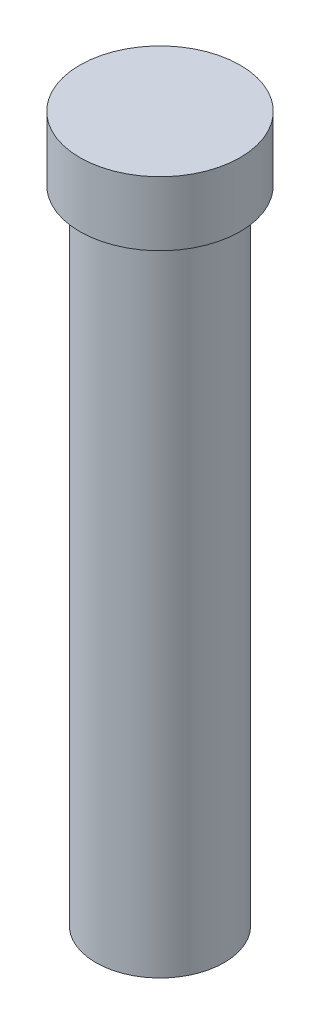
ISO-10303-21;
HEADER;
FILE_DESCRIPTION(('STEP AP214'),'2;1');
FILE_NAME('part.step','',(''),(''),'','','');
FILE_SCHEMA(('AUTOMOTIVE_DESIGN { 1 0 10303 214 1 1 1 1 }'));
ENDSEC;
DATA;
#1=APPLICATION_CONTEXT('core data for automotive mechanical design processes');
#2=APPLICATION_PROTOCOL_DEFINITION('international standard','automotive_design',2000,#1);
#3=PRODUCT_CONTEXT('',#1,'mechanical');
#4=PRODUCT('Part','Part','',(#3));
#5=PRODUCT_RELATED_PRODUCT_CATEGORY('part','',(#4));
#6=PRODUCT_DEFINITION_FORMATION('','',#4);
#7=PRODUCT_DEFINITION_CONTEXT('part definition',#1,'design');
#8=PRODUCT_DEFINITION('design','',#6,#7);
#9=PRODUCT_DEFINITION_SHAPE('','',#8);
#10=(LENGTH_UNIT() NAMED_UNIT(*) SI_UNIT(.MILLI.,.METRE.));
#11=(NAMED_UNIT(*) PLANE_ANGLE_UNIT() SI_UNIT($,.RADIAN.));
#12=(NAMED_UNIT(*) SI_UNIT($,.STERADIAN.) SOLID_ANGLE_UNIT());
#13=UNCERTAINTY_MEASURE_WITH_UNIT(LENGTH_MEASURE(1.E-05),#10,'distance_accuracy_value','');
#14=(GEOMETRIC_REPRESENTATION_CONTEXT(3) GLOBAL_UNCERTAINTY_ASSIGNED_CONTEXT((#13)) GLOBAL_UNIT_ASSIGNED_CONTEXT((#10,
#11,#12)) REPRESENTATION_CONTEXT('',''));
#15=CARTESIAN_POINT('',(0.,0.,0.));
#16=DIRECTION('',(0.,0.,1.));
#17=DIRECTION('',(1.,0.,0.));
#18=AXIS2_PLACEMENT_3D('',#15,#16,#17);
#19=CARTESIAN_POINT('',(0.,20.,0.));
#20=DIRECTION('',(0.,-1.,0.));
#21=DIRECTION('',(0.,0.,-1.));
#22=AXIS2_PLACEMENT_3D('',#19,#20,#21);
#23=CYLINDRICAL_SURFACE('',#22,2.);
#24=CARTESIAN_POINT('',(0.,20.,0.));
#25=DIRECTION('',(0.,1.,0.));
#26=DIRECTION('',(0.,0.,1.));
#27=AXIS2_PLACEMENT_3D('',#24,#25,#26);
#28=CIRCLE('',#27,2.);
#29=CARTESIAN_POINT('',(0.,20.,2.));
#30=VERTEX_POINT('',#29);
#31=EDGE_CURVE('E10',#30,#30,#28,.T.);
#32=ORIENTED_EDGE('',*,*,#31,.F.);
#33=EDGE_LOOP('',(#32));
#34=FACE_BOUND('',#33,.T.);
#35=CARTESIAN_POINT('',(0.,0.,0.));
#36=DIRECTION('',(0.,1.,0.));
#37=DIRECTION('',(0.,0.,1.));
#38=AXIS2_PLACEMENT_3D('',#35,#36,#37);
#39=CIRCLE('',#38,2.);
#40=CARTESIAN_POINT('',(0.,0.,2.));
#41=VERTEX_POINT('',#40);
#42=EDGE_CURVE('E46',#41,#41,#39,.T.);
#43=ORIENTED_EDGE('',*,*,#42,.T.);
#44=EDGE_LOOP('',(#43));
#45=FACE_BOUND('',#44,.T.);
#46=ADVANCED_FACE('F43',(#34,#45),#23,.T.);
#47=CARTESIAN_POINT('',(0.,0.,0.));
#48=DIRECTION('',(0.,1.,0.));
#49=DIRECTION('',(0.,0.,1.));
#50=AXIS2_PLACEMENT_3D('',#47,#48,#49);
#51=PLANE('',#50);
#52=ORIENTED_EDGE('',*,*,#42,.F.);
#53=EDGE_LOOP('',(#52));
#54=FACE_BOUND('',#53,.T.);
#55=ADVANCED_FACE('F70',(#54),#51,.F.);
#56=CARTESIAN_POINT('',(0.,22.,0.));
#57=DIRECTION('',(0.,-1.,0.));
#58=DIRECTION('',(0.,0.,-1.));
#59=AXIS2_PLACEMENT_3D('',#56,#57,#58);
#60=CYLINDRICAL_SURFACE('',#59,2.5);
#61=CARTESIAN_POINT('',(0.,22.,0.));
#62=DIRECTION('',(0.,1.,0.));
#63=DIRECTION('',(0.,0.,1.));
#64=AXIS2_PLACEMENT_3D('',#61,#62,#63);
#65=CIRCLE('',#64,2.5);
#66=CARTESIAN_POINT('',(0.,22.,2.5));
#67=VERTEX_POINT('',#66);
#68=EDGE_CURVE('E55',#67,#67,#65,.T.);
#69=ORIENTED_EDGE('',*,*,#68,.F.);
#70=EDGE_LOOP('',(#69));
#71=FACE_BOUND('',#70,.T.);
#72=CARTESIAN_POINT('',(0.,20.,0.));
#73=DIRECTION('',(0.,1.,0.));
#74=DIRECTION('',(0.,0.,1.));
#75=AXIS2_PLACEMENT_3D('',#72,#73,#74);
#76=CIRCLE('',#75,2.5);
#77=CARTESIAN_POINT('',(0.,20.,2.5));
#78=VERTEX_POINT('',#77);
#79=EDGE_CURVE('E57',#78,#78,#76,.T.);
#80=ORIENTED_EDGE('',*,*,#79,.T.);
#81=EDGE_LOOP('',(#80));
#82=FACE_BOUND('',#81,.T.);
#83=ADVANCED_FACE('F67',(#71,#82),#60,.T.);
#84=CARTESIAN_POINT('',(0.,22.,0.));
#85=DIRECTION('',(0.,1.,0.));
#86=DIRECTION('',(0.,0.,1.));
#87=AXIS2_PLACEMENT_3D('',#84,#85,#86);
#88=PLANE('',#87);
#89=ORIENTED_EDGE('',*,*,#68,.T.);
#90=EDGE_LOOP('',(#89));
#91=FACE_BOUND('',#90,.T.);
#92=ADVANCED_FACE('F65',(#91),#88,.T.);
#93=CARTESIAN_POINT('',(0.,20.,0.));
#94=DIRECTION('',(0.,1.,0.));
#95=DIRECTION('',(0.,0.,1.));
#96=AXIS2_PLACEMENT_3D('',#93,#94,#95);
#97=PLANE('',#96);
#98=ORIENTED_EDGE('',*,*,#31,.T.);
#99=EDGE_LOOP('',(#98));
#100=FACE_BOUND('',#99,.T.);
#101=ORIENTED_EDGE('',*,*,#79,.F.);
#102=EDGE_LOOP('',(#101));
#103=FACE_BOUND('',#102,.T.);
#104=ADVANCED_FACE('F74',(#100,#103),#97,.F.);
#105=CLOSED_SHELL('',(#46,#55,#83,#92,#104));
#106=MANIFOLD_SOLID_BREP('B2',#105);
#107=ADVANCED_BREP_SHAPE_REPRESENTATION('',(#18,#106),#14);
#108=SHAPE_DEFINITION_REPRESENTATION(#9,#107);
ENDSEC;
END-ISO-10303-21;
